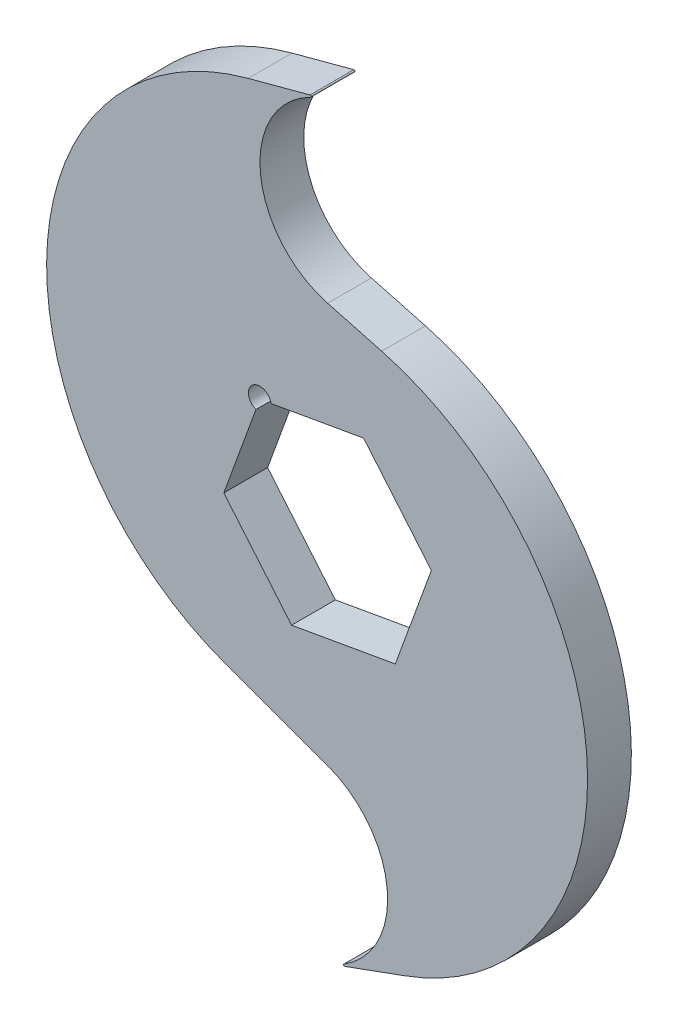
ISO-10303-21;
HEADER;
FILE_DESCRIPTION(('STEP AP214'),'2;1');
FILE_NAME('part.step','',(''),(''),'','','');
FILE_SCHEMA(('AUTOMOTIVE_DESIGN { 1 0 10303 214 1 1 1 1 }'));
ENDSEC;
DATA;
#1=APPLICATION_CONTEXT('core data for automotive mechanical design processes');
#2=APPLICATION_PROTOCOL_DEFINITION('international standard','automotive_design',2000,#1);
#3=PRODUCT_CONTEXT('',#1,'mechanical');
#4=PRODUCT('Part','Part','',(#3));
#5=PRODUCT_RELATED_PRODUCT_CATEGORY('part','',(#4));
#6=PRODUCT_DEFINITION_FORMATION('','',#4);
#7=PRODUCT_DEFINITION_CONTEXT('part definition',#1,'design');
#8=PRODUCT_DEFINITION('design','',#6,#7);
#9=PRODUCT_DEFINITION_SHAPE('','',#8);
#10=(LENGTH_UNIT() NAMED_UNIT(*) SI_UNIT(.MILLI.,.METRE.));
#11=(NAMED_UNIT(*) PLANE_ANGLE_UNIT() SI_UNIT($,.RADIAN.));
#12=(NAMED_UNIT(*) SI_UNIT($,.STERADIAN.) SOLID_ANGLE_UNIT());
#13=UNCERTAINTY_MEASURE_WITH_UNIT(LENGTH_MEASURE(1.E-05),#10,'distance_accuracy_value','');
#14=(GEOMETRIC_REPRESENTATION_CONTEXT(3) GLOBAL_UNCERTAINTY_ASSIGNED_CONTEXT((#13)) GLOBAL_UNIT_ASSIGNED_CONTEXT((#10,
#11,#12)) REPRESENTATION_CONTEXT('',''));
#15=CARTESIAN_POINT('',(0.,0.,0.));
#16=DIRECTION('',(0.,0.,1.));
#17=DIRECTION('',(1.,0.,0.));
#18=AXIS2_PLACEMENT_3D('',#15,#16,#17);
#19=CARTESIAN_POINT('',(-13.0174999999999,48.5819713875279,3.048));
#20=DIRECTION('',(0.258819045102518,-0.965925826289069,0.));
#21=DIRECTION('',(0.965925826289069,0.258819045102518,0.));
#22=AXIS2_PLACEMENT_3D('',#19,#20,#21);
#23=PLANE('',#22);
#24=DIRECTION('',(-0.965925826289069,-0.258819045102518,0.));
#25=VECTOR('',#24,1.);
#26=CARTESIAN_POINT('',(-13.0174999999999,48.5819713875279,3.048));
#27=LINE('',#26,#25);
#28=CARTESIAN_POINT('',(-2.45345159877423,51.4125996254396,3.048));
#29=VERTEX_POINT('',#28);
#30=CARTESIAN_POINT('',(-11.0405321944841,49.1116983144782,3.048));
#31=VERTEX_POINT('',#30);
#32=EDGE_CURVE('E192',#29,#31,#27,.T.);
#33=ORIENTED_EDGE('',*,*,#32,.F.);
#34=DIRECTION('',(0.,0.,1.));
#35=VECTOR('',#34,1.);
#36=CARTESIAN_POINT('',(-2.45345159877423,51.4125996254396,-3.048));
#37=LINE('',#36,#35);
#38=CARTESIAN_POINT('',(-2.45345159877423,51.4125996254396,-3.048));
#39=VERTEX_POINT('',#38);
#40=EDGE_CURVE('E42',#29,#39,#37,.F.);
#41=ORIENTED_EDGE('',*,*,#40,.T.);
#42=DIRECTION('',(-0.965925826289069,-0.258819045102518,0.));
#43=VECTOR('',#42,1.);
#44=CARTESIAN_POINT('',(-13.0174999999999,48.5819713875279,-3.048));
#45=LINE('',#44,#43);
#46=CARTESIAN_POINT('',(-11.0405321944841,49.1116983144782,-3.048));
#47=VERTEX_POINT('',#46);
#48=EDGE_CURVE('E229',#39,#47,#45,.T.);
#49=ORIENTED_EDGE('',*,*,#48,.T.);
#50=DIRECTION('',(0.,0.,-1.));
#51=VECTOR('',#50,1.);
#52=CARTESIAN_POINT('',(-11.0405321944841,49.1116983144782,3.048));
#53=LINE('',#52,#51);
#54=EDGE_CURVE('E260',#31,#47,#53,.T.);
#55=ORIENTED_EDGE('',*,*,#54,.F.);
#56=EDGE_LOOP('',(#33,#41,#49,#55));
#57=FACE_BOUND('',#56,.T.);
#58=ADVANCED_FACE('F34',(#57),#23,.F.);
#59=CARTESIAN_POINT('',(-1.24139416120389,12.5408173038956,3.048));
#60=DIRECTION('',(0.,0.,-1.));
#61=DIRECTION('',(-1.,0.,0.));
#62=AXIS2_PLACEMENT_3D('',#59,#60,#61);
#63=CYLINDRICAL_SURFACE('',#62,37.8609620068675);
#64=CARTESIAN_POINT('',(-1.24139416120389,12.5408173038956,-3.048));
#65=DIRECTION('',(0.,0.,1.));
#66=DIRECTION('',(1.,0.,0.));
#67=AXIS2_PLACEMENT_3D('',#64,#65,#66);
#68=CIRCLE('',#67,37.8609620068675);
#69=CARTESIAN_POINT('',(-14.1906058132406,-23.0368493098134,-3.048));
#70=VERTEX_POINT('',#69);
#71=EDGE_CURVE('E231',#47,#70,#68,.T.);
#72=ORIENTED_EDGE('',*,*,#71,.T.);
#73=DIRECTION('',(0.,0.,-1.));
#74=VECTOR('',#73,1.);
#75=CARTESIAN_POINT('',(-14.1906058132406,-23.0368493098134,3.048));
#76=LINE('',#75,#74);
#77=CARTESIAN_POINT('',(-14.1906058132406,-23.0368493098134,3.048));
#78=VERTEX_POINT('',#77);
#79=EDGE_CURVE('E258',#78,#70,#76,.T.);
#80=ORIENTED_EDGE('',*,*,#79,.F.);
#81=CARTESIAN_POINT('',(-1.24139416120389,12.5408173038956,3.048));
#82=DIRECTION('',(0.,0.,1.));
#83=DIRECTION('',(1.,0.,0.));
#84=AXIS2_PLACEMENT_3D('',#81,#82,#83);
#85=CIRCLE('',#84,37.8609620068675);
#86=EDGE_CURVE('E194',#31,#78,#85,.T.);
#87=ORIENTED_EDGE('',*,*,#86,.F.);
#88=ORIENTED_EDGE('',*,*,#54,.T.);
#89=EDGE_LOOP('',(#72,#80,#87,#88));
#90=FACE_BOUND('',#89,.T.);
#91=ADVANCED_FACE('F298',(#90),#63,.T.);
#92=CARTESIAN_POINT('',(-9.06388619403997,-24.902822650631,3.048));
#93=DIRECTION('',(-0.342020143325673,-0.939692620785907,0.));
#94=DIRECTION('',(0.939692620785907,-0.342020143325673,0.));
#95=AXIS2_PLACEMENT_3D('',#92,#93,#94);
#96=PLANE('',#95);
#97=DIRECTION('',(-0.939692620785907,0.342020143325673,0.));
#98=VECTOR('',#97,1.);
#99=CARTESIAN_POINT('',(-9.06388619403997,-24.902822650631,-3.048));
#100=LINE('',#99,#98);
#101=CARTESIAN_POINT('',(0.,-28.2018074320379,-3.048));
#102=VERTEX_POINT('',#101);
#103=EDGE_CURVE('E234',#102,#70,#100,.T.);
#104=ORIENTED_EDGE('',*,*,#103,.F.);
#105=DIRECTION('',(0.,0.,-1.));
#106=VECTOR('',#105,1.);
#107=CARTESIAN_POINT('',(0.,-28.2018074320379,3.048));
#108=LINE('',#107,#106);
#109=CARTESIAN_POINT('',(0.,-28.2018074320379,3.048));
#110=VERTEX_POINT('',#109);
#111=EDGE_CURVE('E255',#110,#102,#108,.T.);
#112=ORIENTED_EDGE('',*,*,#111,.F.);
#113=DIRECTION('',(-0.939692620785907,0.342020143325673,0.));
#114=VECTOR('',#113,1.);
#115=CARTESIAN_POINT('',(-9.06388619403997,-24.902822650631,3.048));
#116=LINE('',#115,#114);
#117=EDGE_CURVE('E196',#110,#78,#116,.T.);
#118=ORIENTED_EDGE('',*,*,#117,.T.);
#119=ORIENTED_EDGE('',*,*,#79,.T.);
#120=EDGE_LOOP('',(#104,#112,#118,#119));
#121=FACE_BOUND('',#120,.T.);
#122=ADVANCED_FACE('F304',(#121),#96,.T.);
#123=CARTESIAN_POINT('',(-4.34365582023604,-40.135903716019,3.048));
#124=DIRECTION('',(0.,0.,-1.));
#125=DIRECTION('',(-1.,0.,0.));
#126=AXIS2_PLACEMENT_3D('',#123,#124,#125);
#127=CYLINDRICAL_SURFACE('',#126,12.7);
#128=CARTESIAN_POINT('',(-4.34365582023604,-40.135903716019,-3.048));
#129=DIRECTION('',(0.,0.,1.));
#130=DIRECTION('',(1.,0.,0.));
#131=AXIS2_PLACEMENT_3D('',#128,#129,#130);
#132=CIRCLE('',#131,12.7);
#133=CARTESIAN_POINT('',(2.27717439642722,-50.9735513963101,-3.048));
#134=VERTEX_POINT('',#133);
#135=EDGE_CURVE('E237',#134,#102,#132,.T.);
#136=ORIENTED_EDGE('',*,*,#135,.F.);
#137=DIRECTION('',(0.,0.,-1.));
#138=VECTOR('',#137,1.);
#139=CARTESIAN_POINT('',(2.27717439642722,-50.9735513963101,3.048));
#140=LINE('',#139,#138);
#141=CARTESIAN_POINT('',(2.27717439642722,-50.9735513963101,3.048));
#142=VERTEX_POINT('',#141);
#143=EDGE_CURVE('E280',#134,#142,#140,.F.);
#144=ORIENTED_EDGE('',*,*,#143,.T.);
#145=CARTESIAN_POINT('',(-4.34365582023604,-40.135903716019,3.048));
#146=DIRECTION('',(0.,0.,1.));
#147=DIRECTION('',(1.,0.,0.));
#148=AXIS2_PLACEMENT_3D('',#145,#146,#147);
#149=CIRCLE('',#148,12.7);
#150=EDGE_CURVE('E199',#142,#110,#149,.T.);
#151=ORIENTED_EDGE('',*,*,#150,.T.);
#152=ORIENTED_EDGE('',*,*,#111,.T.);
#153=EDGE_LOOP('',(#136,#144,#151,#152));
#154=FACE_BOUND('',#153,.T.);
#155=ADVANCED_FACE('F307',(#154),#127,.F.);
#156=CARTESIAN_POINT('',(16.7349754181892,-45.9789670766024,3.048));
#157=DIRECTION('',(-0.342020143325673,0.939692620785907,0.));
#158=DIRECTION('',(-0.939692620785907,-0.342020143325673,0.));
#159=AXIS2_PLACEMENT_3D('',#156,#157,#158);
#160=PLANE('',#159);
#161=DIRECTION('',(0.939692620785907,0.342020143325673,0.));
#162=VECTOR('',#161,1.);
#163=CARTESIAN_POINT('',(16.7349754181892,-45.9789670766024,3.048));
#164=LINE('',#163,#162);
#165=CARTESIAN_POINT('',(2.38681925679621,-51.2012688359528,3.048));
#166=VERTEX_POINT('',#165);
#167=CARTESIAN_POINT('',(10.7406866555829,-48.1607097617875,3.048));
#168=VERTEX_POINT('',#167);
#169=EDGE_CURVE('E201',#166,#168,#164,.T.);
#170=ORIENTED_EDGE('',*,*,#169,.F.);
#171=DIRECTION('',(0.,0.,1.));
#172=VECTOR('',#171,1.);
#173=CARTESIAN_POINT('',(2.38681925679621,-51.2012688359528,-3.048));
#174=LINE('',#173,#172);
#175=CARTESIAN_POINT('',(2.38681925679621,-51.2012688359528,-3.048));
#176=VERTEX_POINT('',#175);
#177=EDGE_CURVE('E263',#166,#176,#174,.F.);
#178=ORIENTED_EDGE('',*,*,#177,.T.);
#179=DIRECTION('',(0.939692620785907,0.342020143325673,0.));
#180=VECTOR('',#179,1.);
#181=CARTESIAN_POINT('',(16.7349754181892,-45.9789670766024,-3.048));
#182=LINE('',#181,#180);
#183=CARTESIAN_POINT('',(10.7406866555829,-48.1607097617875,-3.048));
#184=VERTEX_POINT('',#183);
#185=EDGE_CURVE('E239',#176,#184,#182,.T.);
#186=ORIENTED_EDGE('',*,*,#185,.T.);
#187=DIRECTION('',(0.,0.,-1.));
#188=VECTOR('',#187,1.);
#189=CARTESIAN_POINT('',(10.7406866555829,-48.1607097617875,3.048));
#190=LINE('',#189,#188);
#191=EDGE_CURVE('E252',#168,#184,#190,.T.);
#192=ORIENTED_EDGE('',*,*,#191,.F.);
#193=EDGE_LOOP('',(#170,#178,#186,#192));
#194=FACE_BOUND('',#193,.T.);
#195=ADVANCED_FACE('F315',(#194),#160,.F.);
#196=CARTESIAN_POINT('',(-2.48342826754325,-11.827752618226,3.048));
#197=DIRECTION('',(0.,0.,-1.));
#198=DIRECTION('',(-1.,0.,0.));
#199=AXIS2_PLACEMENT_3D('',#196,#197,#198);
#200=CYLINDRICAL_SURFACE('',#199,38.6647254004982);
#201=CARTESIAN_POINT('',(-2.48342826754325,-11.827752618226,-3.048));
#202=DIRECTION('',(0.,0.,1.));
#203=DIRECTION('',(1.,0.,0.));
#204=AXIS2_PLACEMENT_3D('',#201,#202,#203);
#205=CIRCLE('',#204,38.6647254004982);
#206=CARTESIAN_POINT('',(7.52373903976478,25.5195042124902,-3.048));
#207=VERTEX_POINT('',#206);
#208=EDGE_CURVE('E241',#184,#207,#205,.T.);
#209=ORIENTED_EDGE('',*,*,#208,.T.);
#210=DIRECTION('',(0.,0.,-1.));
#211=VECTOR('',#210,1.);
#212=CARTESIAN_POINT('',(7.52373903976478,25.5195042124902,3.048));
#213=LINE('',#212,#211);
#214=CARTESIAN_POINT('',(7.52373903976478,25.5195042124902,3.048));
#215=VERTEX_POINT('',#214);
#216=EDGE_CURVE('E250',#215,#207,#213,.T.);
#217=ORIENTED_EDGE('',*,*,#216,.F.);
#218=CARTESIAN_POINT('',(-2.48342826754325,-11.827752618226,3.048));
#219=DIRECTION('',(0.,0.,1.));
#220=DIRECTION('',(1.,0.,0.));
#221=AXIS2_PLACEMENT_3D('',#218,#219,#220);
#222=CIRCLE('',#221,38.6647254004982);
#223=EDGE_CURVE('E203',#168,#215,#222,.T.);
#224=ORIENTED_EDGE('',*,*,#223,.F.);
#225=ORIENTED_EDGE('',*,*,#191,.T.);
#226=EDGE_LOOP('',(#209,#217,#224,#225));
#227=FACE_BOUND('',#226,.T.);
#228=ADVANCED_FACE('F320',(#227),#200,.T.);
#229=CARTESIAN_POINT('',(6.88387100306435,25.6909563361865,3.048));
#230=DIRECTION('',(0.258819045102518,0.965925826289069,0.));
#231=DIRECTION('',(-0.965925826289069,0.258819045102518,0.));
#232=AXIS2_PLACEMENT_3D('',#229,#230,#231);
#233=PLANE('',#232);
#234=DIRECTION('',(0.965925826289069,-0.258819045102518,0.));
#235=VECTOR('',#234,1.);
#236=CARTESIAN_POINT('',(6.88387100306435,25.6909563361865,-3.048));
#237=LINE('',#236,#235);
#238=CARTESIAN_POINT('',(0.,27.5354840122576,-3.048));
#239=VERTEX_POINT('',#238);
#240=EDGE_CURVE('E244',#239,#207,#237,.T.);
#241=ORIENTED_EDGE('',*,*,#240,.F.);
#242=DIRECTION('',(0.,0.,-1.));
#243=VECTOR('',#242,1.);
#244=CARTESIAN_POINT('',(0.,27.5354840122576,3.048));
#245=LINE('',#244,#243);
#246=CARTESIAN_POINT('',(0.,27.5354840122576,3.048));
#247=VERTEX_POINT('',#246);
#248=EDGE_CURVE('E163',#247,#239,#245,.T.);
#249=ORIENTED_EDGE('',*,*,#248,.F.);
#250=DIRECTION('',(0.965925826289069,-0.258819045102518,0.));
#251=VECTOR('',#250,1.);
#252=CARTESIAN_POINT('',(6.88387100306435,25.6909563361865,3.048));
#253=LINE('',#252,#251);
#254=EDGE_CURVE('E205',#247,#215,#253,.T.);
#255=ORIENTED_EDGE('',*,*,#254,.T.);
#256=ORIENTED_EDGE('',*,*,#216,.T.);
#257=EDGE_LOOP('',(#241,#249,#255,#256));
#258=FACE_BOUND('',#257,.T.);
#259=ADVANCED_FACE('F325',(#258),#233,.T.);
#260=CARTESIAN_POINT('',(-9.42628542690064,11.2338095223274,3.048));
#261=DIRECTION('',(0.,0.,-1.));
#262=DIRECTION('',(-1.,0.,0.));
#263=AXIS2_PLACEMENT_3D('',#260,#261,#262);
#264=CYLINDRICAL_SURFACE('',#263,1.5875);
#265=CARTESIAN_POINT('',(-9.42628542690064,11.2338095223274,-3.048));
#266=DIRECTION('',(0.,0.,1.));
#267=DIRECTION('',(1.,0.,0.));
#268=AXIS2_PLACEMENT_3D('',#265,#266,#267);
#269=CIRCLE('',#268,1.5875);
#270=CARTESIAN_POINT('',(-7.86290311899375,11.5094760043737,-3.048));
#271=VERTEX_POINT('',#270);
#272=CARTESIAN_POINT('',(-9.96924240443015,9.74204748682979,-3.048));
#273=VERTEX_POINT('',#272);
#274=EDGE_CURVE('E158',#271,#273,#269,.T.);
#275=ORIENTED_EDGE('',*,*,#274,.F.);
#276=DIRECTION('',(0.,0.,-1.));
#277=VECTOR('',#276,1.);
#278=CARTESIAN_POINT('',(-7.86290311899375,11.5094760043737,3.048));
#279=LINE('',#278,#277);
#280=CARTESIAN_POINT('',(-7.86290311899375,11.5094760043737,3.048));
#281=VERTEX_POINT('',#280);
#282=EDGE_CURVE('E152',#281,#271,#279,.T.);
#283=ORIENTED_EDGE('',*,*,#282,.F.);
#284=CARTESIAN_POINT('',(-9.42628542690064,11.2338095223274,3.048));
#285=DIRECTION('',(0.,0.,1.));
#286=DIRECTION('',(1.,0.,0.));
#287=AXIS2_PLACEMENT_3D('',#284,#285,#286);
#288=CIRCLE('',#287,1.5875);
#289=CARTESIAN_POINT('',(-9.96924240443015,9.74204748682979,3.048));
#290=VERTEX_POINT('',#289);
#291=EDGE_CURVE('E155',#281,#290,#288,.T.);
#292=ORIENTED_EDGE('',*,*,#291,.T.);
#293=DIRECTION('',(0.,0.,-1.));
#294=VECTOR('',#293,1.);
#295=CARTESIAN_POINT('',(-9.96924240443015,9.74204748682979,3.048));
#296=LINE('',#295,#294);
#297=EDGE_CURVE('E210',#290,#273,#296,.T.);
#298=ORIENTED_EDGE('',*,*,#297,.T.);
#299=EDGE_LOOP('',(#275,#283,#292,#298));
#300=FACE_BOUND('',#299,.T.);
#301=ADVANCED_FACE('F154',(#300),#264,.F.);
#302=CARTESIAN_POINT('',(-2.20533185636994,12.5070584632551,3.048));
#303=DIRECTION('',(0.173648177666924,-0.984807753012209,0.));
#304=DIRECTION('',(0.984807753012209,0.173648177666924,0.));
#305=AXIS2_PLACEMENT_3D('',#302,#303,#304);
#306=PLANE('',#305);
#307=DIRECTION('',(-0.984807753012209,-0.173648177666924,0.));
#308=VECTOR('',#307,1.);
#309=CARTESIAN_POINT('',(-2.20533185636994,12.5070584632551,-3.048));
#310=LINE('',#309,#308);
#311=CARTESIAN_POINT('',(5.01562171416074,13.7803074041827,-3.048));
#312=VERTEX_POINT('',#311);
#313=EDGE_CURVE('E212',#312,#271,#310,.T.);
#314=ORIENTED_EDGE('',*,*,#313,.F.);
#315=DIRECTION('',(0.,0.,-1.));
#316=VECTOR('',#315,1.);
#317=CARTESIAN_POINT('',(5.01562171416074,13.7803074041827,3.048));
#318=LINE('',#317,#316);
#319=CARTESIAN_POINT('',(5.01562171416074,13.7803074041827,3.048));
#320=VERTEX_POINT('',#319);
#321=EDGE_CURVE('E164',#320,#312,#318,.T.);
#322=ORIENTED_EDGE('',*,*,#321,.F.);
#323=DIRECTION('',(-0.984807753012209,-0.173648177666924,0.));
#324=VECTOR('',#323,1.);
#325=CARTESIAN_POINT('',(-2.20533185636994,12.5070584632551,3.048));
#326=LINE('',#325,#324);
#327=EDGE_CURVE('E170',#320,#281,#326,.T.);
#328=ORIENTED_EDGE('',*,*,#327,.T.);
#329=ORIENTED_EDGE('',*,*,#282,.T.);
#330=EDGE_LOOP('',(#314,#322,#328,#329));
#331=FACE_BOUND('',#330,.T.);
#332=ADVANCED_FACE('F177',(#331),#306,.T.);
#333=CARTESIAN_POINT('',(9.72876442761106,8.16340264301899,3.048));
#334=DIRECTION('',(-0.766044443118982,-0.642787609686535,0.));
#335=DIRECTION('',(0.642787609686535,-0.766044443118982,0.));
#336=AXIS2_PLACEMENT_3D('',#333,#334,#335);
#337=PLANE('',#336);
#338=DIRECTION('',(-0.642787609686535,0.766044443118982,0.));
#339=VECTOR('',#338,1.);
#340=CARTESIAN_POINT('',(9.72876442761106,8.16340264301899,-3.048));
#341=LINE('',#340,#339);
#342=CARTESIAN_POINT('',(14.4419071410614,2.54649788185528,-3.048));
#343=VERTEX_POINT('',#342);
#344=EDGE_CURVE('E214',#343,#312,#341,.T.);
#345=ORIENTED_EDGE('',*,*,#344,.F.);
#346=DIRECTION('',(0.,0.,-1.));
#347=VECTOR('',#346,1.);
#348=CARTESIAN_POINT('',(14.4419071410614,2.54649788185528,3.048));
#349=LINE('',#348,#347);
#350=CARTESIAN_POINT('',(14.4419071410614,2.54649788185528,3.048));
#351=VERTEX_POINT('',#350);
#352=EDGE_CURVE('E271',#351,#343,#349,.T.);
#353=ORIENTED_EDGE('',*,*,#352,.F.);
#354=DIRECTION('',(-0.642787609686535,0.766044443118982,0.));
#355=VECTOR('',#354,1.);
#356=CARTESIAN_POINT('',(9.72876442761106,8.16340264301899,3.048));
#357=LINE('',#356,#355);
#358=EDGE_CURVE('E178',#351,#320,#357,.T.);
#359=ORIENTED_EDGE('',*,*,#358,.T.);
#360=ORIENTED_EDGE('',*,*,#321,.T.);
#361=EDGE_LOOP('',(#345,#353,#359,#360));
#362=FACE_BOUND('',#361,.T.);
#363=ADVANCED_FACE('F354',(#362),#337,.T.);
#364=CARTESIAN_POINT('',(11.934096283981,-4.34365582023606,3.048));
#365=DIRECTION('',(-0.939692620785906,0.342020143325674,0.));
#366=DIRECTION('',(-0.342020143325674,-0.939692620785906,0.));
#367=AXIS2_PLACEMENT_3D('',#364,#365,#366);
#368=PLANE('',#367);
#369=DIRECTION('',(0.342020143325674,0.939692620785907,0.));
#370=VECTOR('',#369,1.);
#371=CARTESIAN_POINT('',(11.934096283981,-4.34365582023606,-3.048));
#372=LINE('',#371,#370);
#373=CARTESIAN_POINT('',(9.42628542690063,-11.2338095223274,-3.048));
#374=VERTEX_POINT('',#373);
#375=EDGE_CURVE('E217',#374,#343,#372,.T.);
#376=ORIENTED_EDGE('',*,*,#375,.F.);
#377=DIRECTION('',(0.,0.,-1.));
#378=VECTOR('',#377,1.);
#379=CARTESIAN_POINT('',(9.42628542690063,-11.2338095223274,3.048));
#380=LINE('',#379,#378);
#381=CARTESIAN_POINT('',(9.42628542690063,-11.2338095223274,3.048));
#382=VERTEX_POINT('',#381);
#383=EDGE_CURVE('E269',#382,#374,#380,.T.);
#384=ORIENTED_EDGE('',*,*,#383,.F.);
#385=DIRECTION('',(0.342020143325674,0.939692620785907,0.));
#386=VECTOR('',#385,1.);
#387=CARTESIAN_POINT('',(11.934096283981,-4.34365582023606,3.048));
#388=LINE('',#387,#386);
#389=EDGE_CURVE('E180',#382,#351,#388,.T.);
#390=ORIENTED_EDGE('',*,*,#389,.T.);
#391=ORIENTED_EDGE('',*,*,#352,.T.);
#392=EDGE_LOOP('',(#376,#384,#390,#391));
#393=FACE_BOUND('',#392,.T.);
#394=ADVANCED_FACE('F350',(#393),#368,.T.);
#395=CARTESIAN_POINT('',(2.20533185636994,-12.5070584632551,3.048));
#396=DIRECTION('',(-0.173648177666924,0.984807753012209,0.));
#397=DIRECTION('',(-0.984807753012209,-0.173648177666924,0.));
#398=AXIS2_PLACEMENT_3D('',#395,#396,#397);
#399=PLANE('',#398);
#400=DIRECTION('',(0.984807753012209,0.173648177666924,0.));
#401=VECTOR('',#400,1.);
#402=CARTESIAN_POINT('',(2.20533185636994,-12.5070584632551,-3.048));
#403=LINE('',#402,#401);
#404=CARTESIAN_POINT('',(-5.01562171416076,-13.7803074041827,-3.048));
#405=VERTEX_POINT('',#404);
#406=EDGE_CURVE('E220',#405,#374,#403,.T.);
#407=ORIENTED_EDGE('',*,*,#406,.F.);
#408=DIRECTION('',(0.,0.,-1.));
#409=VECTOR('',#408,1.);
#410=CARTESIAN_POINT('',(-5.01562171416076,-13.7803074041827,3.048));
#411=LINE('',#410,#409);
#412=CARTESIAN_POINT('',(-5.01562171416076,-13.7803074041827,3.048));
#413=VERTEX_POINT('',#412);
#414=EDGE_CURVE('E267',#413,#405,#411,.T.);
#415=ORIENTED_EDGE('',*,*,#414,.F.);
#416=DIRECTION('',(0.984807753012209,0.173648177666924,0.));
#417=VECTOR('',#416,1.);
#418=CARTESIAN_POINT('',(2.20533185636994,-12.5070584632551,3.048));
#419=LINE('',#418,#417);
#420=EDGE_CURVE('E185',#413,#382,#419,.T.);
#421=ORIENTED_EDGE('',*,*,#420,.T.);
#422=ORIENTED_EDGE('',*,*,#383,.T.);
#423=EDGE_LOOP('',(#407,#415,#421,#422));
#424=FACE_BOUND('',#423,.T.);
#425=ADVANCED_FACE('F346',(#424),#399,.T.);
#426=CARTESIAN_POINT('',(-9.72876442761107,-8.16340264301899,3.048));
#427=DIRECTION('',(0.766044443118982,0.642787609686535,0.));
#428=DIRECTION('',(-0.642787609686535,0.766044443118982,0.));
#429=AXIS2_PLACEMENT_3D('',#426,#427,#428);
#430=PLANE('',#429);
#431=DIRECTION('',(0.642787609686535,-0.766044443118982,0.));
#432=VECTOR('',#431,1.);
#433=CARTESIAN_POINT('',(-9.72876442761107,-8.16340264301899,-3.048));
#434=LINE('',#433,#432);
#435=CARTESIAN_POINT('',(-14.4419071410614,-2.54649788185529,-3.048));
#436=VERTEX_POINT('',#435);
#437=EDGE_CURVE('E223',#436,#405,#434,.T.);
#438=ORIENTED_EDGE('',*,*,#437,.F.);
#439=DIRECTION('',(0.,0.,-1.));
#440=VECTOR('',#439,1.);
#441=CARTESIAN_POINT('',(-14.4419071410614,-2.54649788185529,3.048));
#442=LINE('',#441,#440);
#443=CARTESIAN_POINT('',(-14.4419071410614,-2.54649788185529,3.048));
#444=VERTEX_POINT('',#443);
#445=EDGE_CURVE('E265',#444,#436,#442,.T.);
#446=ORIENTED_EDGE('',*,*,#445,.F.);
#447=DIRECTION('',(0.642787609686535,-0.766044443118982,0.));
#448=VECTOR('',#447,1.);
#449=CARTESIAN_POINT('',(-9.72876442761107,-8.16340264301899,3.048));
#450=LINE('',#449,#448);
#451=EDGE_CURVE('E188',#444,#413,#450,.T.);
#452=ORIENTED_EDGE('',*,*,#451,.T.);
#453=ORIENTED_EDGE('',*,*,#414,.T.);
#454=EDGE_LOOP('',(#438,#446,#452,#453));
#455=FACE_BOUND('',#454,.T.);
#456=ADVANCED_FACE('F342',(#455),#430,.T.);
#457=CARTESIAN_POINT('',(-11.934096283981,4.34365582023606,3.048));
#458=DIRECTION('',(0.939692620785906,-0.342020143325674,0.));
#459=DIRECTION('',(0.342020143325674,0.939692620785906,0.));
#460=AXIS2_PLACEMENT_3D('',#457,#458,#459);
#461=PLANE('',#460);
#462=DIRECTION('',(-0.342020143325674,-0.939692620785907,0.));
#463=VECTOR('',#462,1.);
#464=CARTESIAN_POINT('',(-11.934096283981,4.34365582023606,-3.048));
#465=LINE('',#464,#463);
#466=EDGE_CURVE('E226',#273,#436,#465,.T.);
#467=ORIENTED_EDGE('',*,*,#466,.F.);
#468=ORIENTED_EDGE('',*,*,#297,.F.);
#469=DIRECTION('',(-0.342020143325674,-0.939692620785907,0.));
#470=VECTOR('',#469,1.);
#471=CARTESIAN_POINT('',(-11.934096283981,4.34365582023606,3.048));
#472=LINE('',#471,#470);
#473=EDGE_CURVE('E174',#290,#444,#472,.T.);
#474=ORIENTED_EDGE('',*,*,#473,.T.);
#475=ORIENTED_EDGE('',*,*,#445,.T.);
#476=EDGE_LOOP('',(#467,#468,#474,#475));
#477=FACE_BOUND('',#476,.T.);
#478=ADVANCED_FACE('F339',(#477),#461,.T.);
#479=CARTESIAN_POINT('',(3.28700187280198,39.8027420061288,3.048));
#480=DIRECTION('',(0.,0.,-1.));
#481=DIRECTION('',(-1.,0.,0.));
#482=AXIS2_PLACEMENT_3D('',#479,#480,#481);
#483=CYLINDRICAL_SURFACE('',#482,12.7);
#484=CARTESIAN_POINT('',(3.28700187280198,39.8027420061288,-3.048));
#485=DIRECTION('',(0.,0.,1.));
#486=DIRECTION('',(1.,0.,0.));
#487=AXIS2_PLACEMENT_3D('',#484,#485,#486);
#488=CIRCLE('',#487,12.7);
#489=CARTESIAN_POINT('',(-2.36407085279029,51.1761925401606,-3.048));
#490=VERTEX_POINT('',#489);
#491=EDGE_CURVE('E175',#490,#239,#488,.T.);
#492=ORIENTED_EDGE('',*,*,#491,.F.);
#493=DIRECTION('',(0.,0.,-1.));
#494=VECTOR('',#493,1.);
#495=CARTESIAN_POINT('',(-2.36407085279029,51.1761925401606,3.048));
#496=LINE('',#495,#494);
#497=CARTESIAN_POINT('',(-2.36407085279029,51.1761925401606,3.048));
#498=VERTEX_POINT('',#497);
#499=EDGE_CURVE('E11',#490,#498,#496,.F.);
#500=ORIENTED_EDGE('',*,*,#499,.T.);
#501=CARTESIAN_POINT('',(3.28700187280198,39.8027420061288,3.048));
#502=DIRECTION('',(0.,0.,1.));
#503=DIRECTION('',(1.,0.,0.));
#504=AXIS2_PLACEMENT_3D('',#501,#502,#503);
#505=CIRCLE('',#504,12.7);
#506=EDGE_CURVE('E208',#498,#247,#505,.T.);
#507=ORIENTED_EDGE('',*,*,#506,.T.);
#508=ORIENTED_EDGE('',*,*,#248,.T.);
#509=EDGE_LOOP('',(#492,#500,#507,#508));
#510=FACE_BOUND('',#509,.T.);
#511=ADVANCED_FACE('F326',(#510),#483,.F.);
#512=CARTESIAN_POINT('',(0.,0.,3.048));
#513=DIRECTION('',(0.,0.,1.));
#514=DIRECTION('',(1.,0.,0.));
#515=AXIS2_PLACEMENT_3D('',#512,#513,#514);
#516=PLANE('',#515);
#517=ORIENTED_EDGE('',*,*,#291,.F.);
#518=ORIENTED_EDGE('',*,*,#327,.F.);
#519=ORIENTED_EDGE('',*,*,#358,.F.);
#520=ORIENTED_EDGE('',*,*,#389,.F.);
#521=ORIENTED_EDGE('',*,*,#420,.F.);
#522=ORIENTED_EDGE('',*,*,#451,.F.);
#523=ORIENTED_EDGE('',*,*,#473,.F.);
#524=EDGE_LOOP('',(#517,#518,#519,#520,#521,#522,#523));
#525=FACE_BOUND('',#524,.T.);
#526=ORIENTED_EDGE('',*,*,#150,.F.);
#527=CARTESIAN_POINT('',(2.34338269859385,-51.081927873113,3.048));
#528=DIRECTION('',(0.,0.,1.));
#529=DIRECTION('',(1.,0.,0.));
#530=AXIS2_PLACEMENT_3D('',#527,#528,#529);
#531=CIRCLE('',#530,0.127);
#532=EDGE_CURVE('E283',#142,#166,#531,.T.);
#533=ORIENTED_EDGE('',*,*,#532,.T.);
#534=ORIENTED_EDGE('',*,*,#169,.T.);
#535=ORIENTED_EDGE('',*,*,#223,.T.);
#536=ORIENTED_EDGE('',*,*,#254,.F.);
#537=ORIENTED_EDGE('',*,*,#506,.F.);
#538=CARTESIAN_POINT('',(-2.42058158004621,51.2899270455009,3.048));
#539=DIRECTION('',(0.,0.,1.));
#540=DIRECTION('',(1.,0.,0.));
#541=AXIS2_PLACEMENT_3D('',#538,#539,#540);
#542=CIRCLE('',#541,0.127);
#543=EDGE_CURVE('E54',#498,#29,#542,.T.);
#544=ORIENTED_EDGE('',*,*,#543,.T.);
#545=ORIENTED_EDGE('',*,*,#32,.T.);
#546=ORIENTED_EDGE('',*,*,#86,.T.);
#547=ORIENTED_EDGE('',*,*,#117,.F.);
#548=EDGE_LOOP('',(#526,#533,#534,#535,#536,#537,#544,#545,#546,#547));
#549=FACE_BOUND('',#548,.T.);
#550=ADVANCED_FACE('F168',(#525,#549),#516,.T.);
#551=CARTESIAN_POINT('',(0.,0.,-3.048));
#552=DIRECTION('',(0.,0.,1.));
#553=DIRECTION('',(1.,0.,0.));
#554=AXIS2_PLACEMENT_3D('',#551,#552,#553);
#555=PLANE('',#554);
#556=ORIENTED_EDGE('',*,*,#274,.T.);
#557=ORIENTED_EDGE('',*,*,#466,.T.);
#558=ORIENTED_EDGE('',*,*,#437,.T.);
#559=ORIENTED_EDGE('',*,*,#406,.T.);
#560=ORIENTED_EDGE('',*,*,#375,.T.);
#561=ORIENTED_EDGE('',*,*,#344,.T.);
#562=ORIENTED_EDGE('',*,*,#313,.T.);
#563=EDGE_LOOP('',(#556,#557,#558,#559,#560,#561,#562));
#564=FACE_BOUND('',#563,.T.);
#565=ORIENTED_EDGE('',*,*,#185,.F.);
#566=CARTESIAN_POINT('',(2.34338269859385,-51.081927873113,-3.048));
#567=DIRECTION('',(0.,0.,1.));
#568=DIRECTION('',(1.,0.,0.));
#569=AXIS2_PLACEMENT_3D('',#566,#567,#568);
#570=CIRCLE('',#569,0.127);
#571=EDGE_CURVE('E278',#176,#134,#570,.F.);
#572=ORIENTED_EDGE('',*,*,#571,.T.);
#573=ORIENTED_EDGE('',*,*,#135,.T.);
#574=ORIENTED_EDGE('',*,*,#103,.T.);
#575=ORIENTED_EDGE('',*,*,#71,.F.);
#576=ORIENTED_EDGE('',*,*,#48,.F.);
#577=CARTESIAN_POINT('',(-2.42058158004621,51.2899270455009,-3.048));
#578=DIRECTION('',(0.,0.,1.));
#579=DIRECTION('',(1.,0.,0.));
#580=AXIS2_PLACEMENT_3D('',#577,#578,#579);
#581=CIRCLE('',#580,0.127);
#582=EDGE_CURVE('E276',#39,#490,#581,.F.);
#583=ORIENTED_EDGE('',*,*,#582,.T.);
#584=ORIENTED_EDGE('',*,*,#491,.T.);
#585=ORIENTED_EDGE('',*,*,#240,.T.);
#586=ORIENTED_EDGE('',*,*,#208,.F.);
#587=EDGE_LOOP('',(#565,#572,#573,#574,#575,#576,#583,#584,#585,#586));
#588=FACE_BOUND('',#587,.T.);
#589=ADVANCED_FACE('F293',(#564,#588),#555,.F.);
#590=CARTESIAN_POINT('',(2.34338269859385,-51.081927873113,3.048));
#591=DIRECTION('',(0.,0.,-1.));
#592=DIRECTION('',(-1.,0.,0.));
#593=AXIS2_PLACEMENT_3D('',#590,#591,#592);
#594=CYLINDRICAL_SURFACE('',#593,0.127);
#595=ORIENTED_EDGE('',*,*,#532,.F.);
#596=ORIENTED_EDGE('',*,*,#143,.F.);
#597=ORIENTED_EDGE('',*,*,#571,.F.);
#598=ORIENTED_EDGE('',*,*,#177,.F.);
#599=EDGE_LOOP('',(#595,#596,#597,#598));
#600=FACE_BOUND('',#599,.T.);
#601=ADVANCED_FACE('F310',(#600),#594,.T.);
#602=CARTESIAN_POINT('',(-2.42058158004621,51.2899270455009,3.048));
#603=DIRECTION('',(0.,0.,-1.));
#604=DIRECTION('',(-1.,0.,0.));
#605=AXIS2_PLACEMENT_3D('',#602,#603,#604);
#606=CYLINDRICAL_SURFACE('',#605,0.127);
#607=ORIENTED_EDGE('',*,*,#543,.F.);
#608=ORIENTED_EDGE('',*,*,#499,.F.);
#609=ORIENTED_EDGE('',*,*,#582,.F.);
#610=ORIENTED_EDGE('',*,*,#40,.F.);
#611=EDGE_LOOP('',(#607,#608,#609,#610));
#612=FACE_BOUND('',#611,.T.);
#613=ADVANCED_FACE('F36',(#612),#606,.T.);
#614=CLOSED_SHELL('',(#58,#91,#122,#155,#195,#228,#259,#301,#332,#363,#394,#425,#456,#478,#511,
#550,#589,#601,#613));
#615=MANIFOLD_SOLID_BREP('B2',#614);
#616=ADVANCED_BREP_SHAPE_REPRESENTATION('',(#18,#615),#14);
#617=SHAPE_DEFINITION_REPRESENTATION(#9,#616);
ENDSEC;
END-ISO-10303-21;
